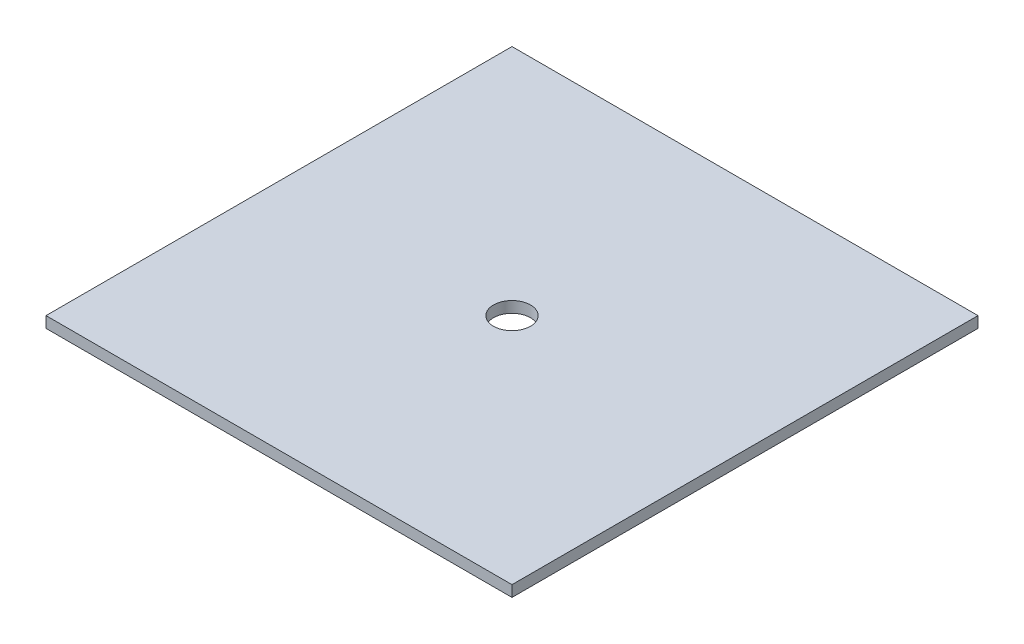
ISO-10303-21;
HEADER;
FILE_DESCRIPTION(('STEP AP214'),'2;1');
FILE_NAME('part.step','',(''),(''),'','','');
FILE_SCHEMA(('AUTOMOTIVE_DESIGN { 1 0 10303 214 1 1 1 1 }'));
ENDSEC;
DATA;
#1=APPLICATION_CONTEXT('core data for automotive mechanical design processes');
#2=APPLICATION_PROTOCOL_DEFINITION('international standard','automotive_design',2000,#1);
#3=PRODUCT_CONTEXT('',#1,'mechanical');
#4=PRODUCT('Part','Part','',(#3));
#5=PRODUCT_RELATED_PRODUCT_CATEGORY('part','',(#4));
#6=PRODUCT_DEFINITION_FORMATION('','',#4);
#7=PRODUCT_DEFINITION_CONTEXT('part definition',#1,'design');
#8=PRODUCT_DEFINITION('design','',#6,#7);
#9=PRODUCT_DEFINITION_SHAPE('','',#8);
#10=(LENGTH_UNIT() NAMED_UNIT(*) SI_UNIT(.MILLI.,.METRE.));
#11=(NAMED_UNIT(*) PLANE_ANGLE_UNIT() SI_UNIT($,.RADIAN.));
#12=(NAMED_UNIT(*) SI_UNIT($,.STERADIAN.) SOLID_ANGLE_UNIT());
#13=UNCERTAINTY_MEASURE_WITH_UNIT(LENGTH_MEASURE(1.E-05),#10,'distance_accuracy_value','');
#14=(GEOMETRIC_REPRESENTATION_CONTEXT(3) GLOBAL_UNCERTAINTY_ASSIGNED_CONTEXT((#13)) GLOBAL_UNIT_ASSIGNED_CONTEXT((#10,
#11,#12)) REPRESENTATION_CONTEXT('',''));
#15=CARTESIAN_POINT('',(0.,0.,0.));
#16=DIRECTION('',(0.,0.,1.));
#17=DIRECTION('',(1.,0.,0.));
#18=AXIS2_PLACEMENT_3D('',#15,#16,#17);
#19=CARTESIAN_POINT('',(0.,4.7625,0.));
#20=DIRECTION('',(0.,-1.,0.));
#21=DIRECTION('',(0.,0.,-1.));
#22=AXIS2_PLACEMENT_3D('',#19,#20,#21);
#23=PLANE('',#22);
#24=DIRECTION('',(0.,0.,1.));
#25=VECTOR('',#24,1.);
#26=CARTESIAN_POINT('',(-100.,4.7625,-100.));
#27=LINE('',#26,#25);
#28=CARTESIAN_POINT('',(-100.,4.7625,-100.));
#29=VERTEX_POINT('',#28);
#30=CARTESIAN_POINT('',(-100.,4.7625,100.));
#31=VERTEX_POINT('',#30);
#32=EDGE_CURVE('E85',#29,#31,#27,.T.);
#33=ORIENTED_EDGE('',*,*,#32,.T.);
#34=DIRECTION('',(1.,0.,0.));
#35=VECTOR('',#34,1.);
#36=CARTESIAN_POINT('',(100.,4.7625,100.));
#37=LINE('',#36,#35);
#38=CARTESIAN_POINT('',(100.,4.7625,100.));
#39=VERTEX_POINT('',#38);
#40=EDGE_CURVE('E80',#31,#39,#37,.T.);
#41=ORIENTED_EDGE('',*,*,#40,.T.);
#42=DIRECTION('',(0.,0.,-1.));
#43=VECTOR('',#42,1.);
#44=CARTESIAN_POINT('',(100.,4.7625,-100.));
#45=LINE('',#44,#43);
#46=CARTESIAN_POINT('',(100.,4.7625,-100.));
#47=VERTEX_POINT('',#46);
#48=EDGE_CURVE('E83',#39,#47,#45,.T.);
#49=ORIENTED_EDGE('',*,*,#48,.T.);
#50=DIRECTION('',(-1.,0.,0.));
#51=VECTOR('',#50,1.);
#52=CARTESIAN_POINT('',(100.,4.7625,-100.));
#53=LINE('',#52,#51);
#54=EDGE_CURVE('E50',#47,#29,#53,.T.);
#55=ORIENTED_EDGE('',*,*,#54,.T.);
#56=EDGE_LOOP('',(#33,#41,#49,#55));
#57=FACE_BOUND('',#56,.T.);
#58=CARTESIAN_POINT('',(0.,4.7625,0.));
#59=DIRECTION('',(0.,1.,0.));
#60=DIRECTION('',(0.,0.,1.));
#61=AXIS2_PLACEMENT_3D('',#58,#59,#60);
#62=CIRCLE('',#61,7.9375);
#63=CARTESIAN_POINT('',(0.,4.7625,7.9375));
#64=VERTEX_POINT('',#63);
#65=EDGE_CURVE('E100',#64,#64,#62,.T.);
#66=ORIENTED_EDGE('',*,*,#65,.F.);
#67=EDGE_LOOP('',(#66));
#68=FACE_BOUND('',#67,.T.);
#69=ADVANCED_FACE('F33',(#57,#68),#23,.F.);
#70=CARTESIAN_POINT('',(0.,0.,0.));
#71=DIRECTION('',(0.,-1.,0.));
#72=DIRECTION('',(0.,0.,-1.));
#73=AXIS2_PLACEMENT_3D('',#70,#71,#72);
#74=PLANE('',#73);
#75=DIRECTION('',(0.,0.,1.));
#76=VECTOR('',#75,1.);
#77=CARTESIAN_POINT('',(-100.,0.,-100.));
#78=LINE('',#77,#76);
#79=CARTESIAN_POINT('',(-100.,0.,-100.));
#80=VERTEX_POINT('',#79);
#81=CARTESIAN_POINT('',(-100.,0.,100.));
#82=VERTEX_POINT('',#81);
#83=EDGE_CURVE('E97',#80,#82,#78,.T.);
#84=ORIENTED_EDGE('',*,*,#83,.F.);
#85=DIRECTION('',(-1.,0.,0.));
#86=VECTOR('',#85,1.);
#87=CARTESIAN_POINT('',(100.,0.,-100.));
#88=LINE('',#87,#86);
#89=CARTESIAN_POINT('',(100.,0.,-100.));
#90=VERTEX_POINT('',#89);
#91=EDGE_CURVE('E73',#90,#80,#88,.T.);
#92=ORIENTED_EDGE('',*,*,#91,.F.);
#93=DIRECTION('',(0.,0.,-1.));
#94=VECTOR('',#93,1.);
#95=CARTESIAN_POINT('',(100.,0.,-100.));
#96=LINE('',#95,#94);
#97=CARTESIAN_POINT('',(100.,0.,100.));
#98=VERTEX_POINT('',#97);
#99=EDGE_CURVE('E67',#98,#90,#96,.T.);
#100=ORIENTED_EDGE('',*,*,#99,.F.);
#101=DIRECTION('',(1.,0.,0.));
#102=VECTOR('',#101,1.);
#103=CARTESIAN_POINT('',(100.,0.,100.));
#104=LINE('',#103,#102);
#105=EDGE_CURVE('E89',#82,#98,#104,.T.);
#106=ORIENTED_EDGE('',*,*,#105,.F.);
#107=EDGE_LOOP('',(#84,#92,#100,#106));
#108=FACE_BOUND('',#107,.T.);
#109=CARTESIAN_POINT('',(0.,0.,0.));
#110=DIRECTION('',(0.,1.,0.));
#111=DIRECTION('',(0.,0.,1.));
#112=AXIS2_PLACEMENT_3D('',#109,#110,#111);
#113=CIRCLE('',#112,7.9375);
#114=CARTESIAN_POINT('',(0.,0.,7.9375));
#115=VERTEX_POINT('',#114);
#116=EDGE_CURVE('E112',#115,#115,#113,.T.);
#117=ORIENTED_EDGE('',*,*,#116,.T.);
#118=EDGE_LOOP('',(#117));
#119=FACE_BOUND('',#118,.T.);
#120=ADVANCED_FACE('F108',(#108,#119),#74,.T.);
#121=CARTESIAN_POINT('',(-100.,4.7625,-100.));
#122=DIRECTION('',(1.,0.,0.));
#123=DIRECTION('',(0.,0.,-1.));
#124=AXIS2_PLACEMENT_3D('',#121,#122,#123);
#125=PLANE('',#124);
#126=ORIENTED_EDGE('',*,*,#83,.T.);
#127=DIRECTION('',(0.,-1.,0.));
#128=VECTOR('',#127,1.);
#129=CARTESIAN_POINT('',(-100.,4.7625,100.));
#130=LINE('',#129,#128);
#131=EDGE_CURVE('E11',#31,#82,#130,.T.);
#132=ORIENTED_EDGE('',*,*,#131,.F.);
#133=ORIENTED_EDGE('',*,*,#32,.F.);
#134=DIRECTION('',(0.,-1.,0.));
#135=VECTOR('',#134,1.);
#136=CARTESIAN_POINT('',(-100.,4.7625,-100.));
#137=LINE('',#136,#135);
#138=EDGE_CURVE('E93',#29,#80,#137,.T.);
#139=ORIENTED_EDGE('',*,*,#138,.T.);
#140=EDGE_LOOP('',(#126,#132,#133,#139));
#141=FACE_BOUND('',#140,.T.);
#142=ADVANCED_FACE('F35',(#141),#125,.F.);
#143=CARTESIAN_POINT('',(100.,4.7625,100.));
#144=DIRECTION('',(0.,0.,-1.));
#145=DIRECTION('',(-1.,0.,0.));
#146=AXIS2_PLACEMENT_3D('',#143,#144,#145);
#147=PLANE('',#146);
#148=ORIENTED_EDGE('',*,*,#105,.T.);
#149=DIRECTION('',(0.,-1.,0.));
#150=VECTOR('',#149,1.);
#151=CARTESIAN_POINT('',(100.,4.7625,100.));
#152=LINE('',#151,#150);
#153=EDGE_CURVE('E42',#39,#98,#152,.T.);
#154=ORIENTED_EDGE('',*,*,#153,.F.);
#155=ORIENTED_EDGE('',*,*,#40,.F.);
#156=ORIENTED_EDGE('',*,*,#131,.T.);
#157=EDGE_LOOP('',(#148,#154,#155,#156));
#158=FACE_BOUND('',#157,.T.);
#159=ADVANCED_FACE('F88',(#158),#147,.F.);
#160=CARTESIAN_POINT('',(100.,4.7625,-100.));
#161=DIRECTION('',(-1.,0.,0.));
#162=DIRECTION('',(0.,0.,1.));
#163=AXIS2_PLACEMENT_3D('',#160,#161,#162);
#164=PLANE('',#163);
#165=ORIENTED_EDGE('',*,*,#99,.T.);
#166=DIRECTION('',(0.,-1.,0.));
#167=VECTOR('',#166,1.);
#168=CARTESIAN_POINT('',(100.,4.7625,-100.));
#169=LINE('',#168,#167);
#170=EDGE_CURVE('E90',#47,#90,#169,.T.);
#171=ORIENTED_EDGE('',*,*,#170,.F.);
#172=ORIENTED_EDGE('',*,*,#48,.F.);
#173=ORIENTED_EDGE('',*,*,#153,.T.);
#174=EDGE_LOOP('',(#165,#171,#172,#173));
#175=FACE_BOUND('',#174,.T.);
#176=ADVANCED_FACE('F91',(#175),#164,.F.);
#177=CARTESIAN_POINT('',(100.,4.7625,-100.));
#178=DIRECTION('',(0.,0.,1.));
#179=DIRECTION('',(1.,0.,0.));
#180=AXIS2_PLACEMENT_3D('',#177,#178,#179);
#181=PLANE('',#180);
#182=ORIENTED_EDGE('',*,*,#91,.T.);
#183=ORIENTED_EDGE('',*,*,#138,.F.);
#184=ORIENTED_EDGE('',*,*,#54,.F.);
#185=ORIENTED_EDGE('',*,*,#170,.T.);
#186=EDGE_LOOP('',(#182,#183,#184,#185));
#187=FACE_BOUND('',#186,.T.);
#188=ADVANCED_FACE('F105',(#187),#181,.F.);
#189=CARTESIAN_POINT('',(0.,4.7625,0.));
#190=DIRECTION('',(0.,-1.,0.));
#191=DIRECTION('',(0.,0.,-1.));
#192=AXIS2_PLACEMENT_3D('',#189,#190,#191);
#193=CYLINDRICAL_SURFACE('',#192,7.9375);
#194=ORIENTED_EDGE('',*,*,#65,.T.);
#195=EDGE_LOOP('',(#194));
#196=FACE_BOUND('',#195,.T.);
#197=ORIENTED_EDGE('',*,*,#116,.F.);
#198=EDGE_LOOP('',(#197));
#199=FACE_BOUND('',#198,.T.);
#200=ADVANCED_FACE('F118',(#196,#199),#193,.F.);
#201=CLOSED_SHELL('',(#69,#120,#142,#159,#176,#188,#200));
#202=MANIFOLD_SOLID_BREP('B2',#201);
#203=ADVANCED_BREP_SHAPE_REPRESENTATION('',(#18,#202),#14);
#204=SHAPE_DEFINITION_REPRESENTATION(#9,#203);
ENDSEC;
END-ISO-10303-21;
